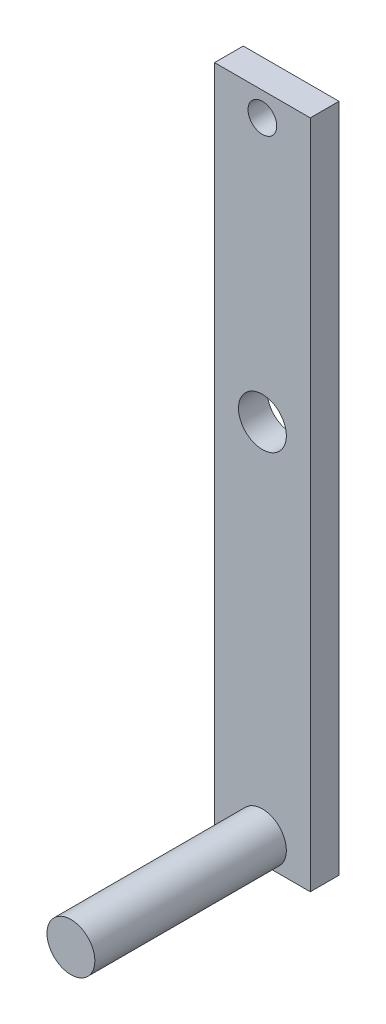
ISO-10303-21;
HEADER;
FILE_DESCRIPTION(('STEP AP214'),'2;1');
FILE_NAME('part.step','',(''),(''),'','','');
FILE_SCHEMA(('AUTOMOTIVE_DESIGN { 1 0 10303 214 1 1 1 1 }'));
ENDSEC;
DATA;
#1=APPLICATION_CONTEXT('core data for automotive mechanical design processes');
#2=APPLICATION_PROTOCOL_DEFINITION('international standard','automotive_design',2000,#1);
#3=PRODUCT_CONTEXT('',#1,'mechanical');
#4=PRODUCT('Part','Part','',(#3));
#5=PRODUCT_RELATED_PRODUCT_CATEGORY('part','',(#4));
#6=PRODUCT_DEFINITION_FORMATION('','',#4);
#7=PRODUCT_DEFINITION_CONTEXT('part definition',#1,'design');
#8=PRODUCT_DEFINITION('design','',#6,#7);
#9=PRODUCT_DEFINITION_SHAPE('','',#8);
#10=(LENGTH_UNIT() NAMED_UNIT(*) SI_UNIT(.MILLI.,.METRE.));
#11=(NAMED_UNIT(*) PLANE_ANGLE_UNIT() SI_UNIT($,.RADIAN.));
#12=(NAMED_UNIT(*) SI_UNIT($,.STERADIAN.) SOLID_ANGLE_UNIT());
#13=UNCERTAINTY_MEASURE_WITH_UNIT(LENGTH_MEASURE(1.E-05),#10,'distance_accuracy_value','');
#14=(GEOMETRIC_REPRESENTATION_CONTEXT(3) GLOBAL_UNCERTAINTY_ASSIGNED_CONTEXT((#13)) GLOBAL_UNIT_ASSIGNED_CONTEXT((#10,
#11,#12)) REPRESENTATION_CONTEXT('',''));
#15=CARTESIAN_POINT('',(0.,0.,0.));
#16=DIRECTION('',(0.,0.,1.));
#17=DIRECTION('',(1.,0.,0.));
#18=AXIS2_PLACEMENT_3D('',#15,#16,#17);
#19=CARTESIAN_POINT('',(0.,0.,3.));
#20=DIRECTION('',(1.,0.,0.));
#21=DIRECTION('',(0.,0.,-1.));
#22=AXIS2_PLACEMENT_3D('',#19,#20,#21);
#23=PLANE('',#22);
#24=DIRECTION('',(0.,-1.,0.));
#25=VECTOR('',#24,1.);
#26=CARTESIAN_POINT('',(0.,0.,0.));
#27=LINE('',#26,#25);
#28=CARTESIAN_POINT('',(0.,70.,0.));
#29=VERTEX_POINT('',#28);
#30=CARTESIAN_POINT('',(0.,0.,0.));
#31=VERTEX_POINT('',#30);
#32=EDGE_CURVE('E102',#29,#31,#27,.T.);
#33=ORIENTED_EDGE('',*,*,#32,.T.);
#34=DIRECTION('',(0.,0.,-1.));
#35=VECTOR('',#34,1.);
#36=CARTESIAN_POINT('',(0.,0.,3.));
#37=LINE('',#36,#35);
#38=CARTESIAN_POINT('',(0.,0.,3.));
#39=VERTEX_POINT('',#38);
#40=EDGE_CURVE('E11',#39,#31,#37,.T.);
#41=ORIENTED_EDGE('',*,*,#40,.F.);
#42=DIRECTION('',(0.,-1.,0.));
#43=VECTOR('',#42,1.);
#44=CARTESIAN_POINT('',(0.,0.,3.));
#45=LINE('',#44,#43);
#46=CARTESIAN_POINT('',(0.,70.,3.));
#47=VERTEX_POINT('',#46);
#48=EDGE_CURVE('E88',#47,#39,#45,.T.);
#49=ORIENTED_EDGE('',*,*,#48,.F.);
#50=DIRECTION('',(0.,0.,-1.));
#51=VECTOR('',#50,1.);
#52=CARTESIAN_POINT('',(0.,70.,3.));
#53=LINE('',#52,#51);
#54=EDGE_CURVE('E101',#47,#29,#53,.T.);
#55=ORIENTED_EDGE('',*,*,#54,.T.);
#56=EDGE_LOOP('',(#33,#41,#49,#55));
#57=FACE_BOUND('',#56,.T.);
#58=ADVANCED_FACE('F33',(#57),#23,.F.);
#59=CARTESIAN_POINT('',(0.,0.,3.));
#60=DIRECTION('',(0.,1.,0.));
#61=DIRECTION('',(0.,0.,1.));
#62=AXIS2_PLACEMENT_3D('',#59,#60,#61);
#63=PLANE('',#62);
#64=DIRECTION('',(1.,0.,0.));
#65=VECTOR('',#64,1.);
#66=CARTESIAN_POINT('',(0.,0.,0.));
#67=LINE('',#66,#65);
#68=CARTESIAN_POINT('',(10.,0.,0.));
#69=VERTEX_POINT('',#68);
#70=EDGE_CURVE('E105',#31,#69,#67,.T.);
#71=ORIENTED_EDGE('',*,*,#70,.T.);
#72=DIRECTION('',(0.,0.,-1.));
#73=VECTOR('',#72,1.);
#74=CARTESIAN_POINT('',(10.,0.,3.));
#75=LINE('',#74,#73);
#76=CARTESIAN_POINT('',(10.,0.,3.));
#77=VERTEX_POINT('',#76);
#78=EDGE_CURVE('E41',#77,#69,#75,.T.);
#79=ORIENTED_EDGE('',*,*,#78,.F.);
#80=DIRECTION('',(1.,0.,0.));
#81=VECTOR('',#80,1.);
#82=CARTESIAN_POINT('',(0.,0.,3.));
#83=LINE('',#82,#81);
#84=CARTESIAN_POINT('',(5.,0.,3.));
#85=VERTEX_POINT('',#84);
#86=EDGE_CURVE('E91',#85,#77,#83,.T.);
#87=ORIENTED_EDGE('',*,*,#86,.F.);
#88=EDGE_CURVE('E80',#39,#85,#83,.T.);
#89=ORIENTED_EDGE('',*,*,#88,.F.);
#90=ORIENTED_EDGE('',*,*,#40,.T.);
#91=EDGE_LOOP('',(#71,#79,#87,#89,#90));
#92=FACE_BOUND('',#91,.T.);
#93=ADVANCED_FACE('F94',(#92),#63,.F.);
#94=CARTESIAN_POINT('',(10.,0.,3.));
#95=DIRECTION('',(-1.,0.,0.));
#96=DIRECTION('',(0.,0.,1.));
#97=AXIS2_PLACEMENT_3D('',#94,#95,#96);
#98=PLANE('',#97);
#99=DIRECTION('',(0.,1.,0.));
#100=VECTOR('',#99,1.);
#101=CARTESIAN_POINT('',(10.,0.,0.));
#102=LINE('',#101,#100);
#103=CARTESIAN_POINT('',(10.,70.,0.));
#104=VERTEX_POINT('',#103);
#105=EDGE_CURVE('E67',#69,#104,#102,.T.);
#106=ORIENTED_EDGE('',*,*,#105,.T.);
#107=DIRECTION('',(0.,0.,-1.));
#108=VECTOR('',#107,1.);
#109=CARTESIAN_POINT('',(10.,70.,3.));
#110=LINE('',#109,#108);
#111=CARTESIAN_POINT('',(10.,70.,3.));
#112=VERTEX_POINT('',#111);
#113=EDGE_CURVE('E111',#112,#104,#110,.T.);
#114=ORIENTED_EDGE('',*,*,#113,.F.);
#115=DIRECTION('',(0.,1.,0.));
#116=VECTOR('',#115,1.);
#117=CARTESIAN_POINT('',(10.,0.,3.));
#118=LINE('',#117,#116);
#119=EDGE_CURVE('E90',#77,#112,#118,.T.);
#120=ORIENTED_EDGE('',*,*,#119,.F.);
#121=ORIENTED_EDGE('',*,*,#78,.T.);
#122=EDGE_LOOP('',(#106,#114,#120,#121));
#123=FACE_BOUND('',#122,.T.);
#124=ADVANCED_FACE('F112',(#123),#98,.F.);
#125=CARTESIAN_POINT('',(0.,70.,3.));
#126=DIRECTION('',(0.,-1.,0.));
#127=DIRECTION('',(0.,0.,-1.));
#128=AXIS2_PLACEMENT_3D('',#125,#126,#127);
#129=PLANE('',#128);
#130=DIRECTION('',(-1.,0.,0.));
#131=VECTOR('',#130,1.);
#132=CARTESIAN_POINT('',(0.,70.,0.));
#133=LINE('',#132,#131);
#134=EDGE_CURVE('E73',#104,#29,#133,.T.);
#135=ORIENTED_EDGE('',*,*,#134,.T.);
#136=ORIENTED_EDGE('',*,*,#54,.F.);
#137=DIRECTION('',(-1.,0.,0.));
#138=VECTOR('',#137,1.);
#139=CARTESIAN_POINT('',(0.,70.,3.));
#140=LINE('',#139,#138);
#141=EDGE_CURVE('E49',#112,#47,#140,.T.);
#142=ORIENTED_EDGE('',*,*,#141,.F.);
#143=ORIENTED_EDGE('',*,*,#113,.T.);
#144=EDGE_LOOP('',(#135,#136,#142,#143));
#145=FACE_BOUND('',#144,.T.);
#146=ADVANCED_FACE('F117',(#145),#129,.F.);
#147=CARTESIAN_POINT('',(0.,0.,3.));
#148=DIRECTION('',(0.,0.,-1.));
#149=DIRECTION('',(-1.,0.,0.));
#150=AXIS2_PLACEMENT_3D('',#147,#148,#149);
#151=PLANE('',#150);
#152=CARTESIAN_POINT('',(5.,40.,3.));
#153=DIRECTION('',(0.,0.,-1.));
#154=DIRECTION('',(-1.,0.,0.));
#155=AXIS2_PLACEMENT_3D('',#152,#153,#154);
#156=CIRCLE('',#155,2.5);
#157=CARTESIAN_POINT('',(2.5,40.,3.));
#158=VERTEX_POINT('',#157);
#159=EDGE_CURVE('E208',#158,#158,#156,.T.);
#160=ORIENTED_EDGE('',*,*,#159,.T.);
#161=EDGE_LOOP('',(#160));
#162=FACE_BOUND('',#161,.T.);
#163=CARTESIAN_POINT('',(5.,67.5,3.));
#164=DIRECTION('',(0.,0.,-1.));
#165=DIRECTION('',(-1.,0.,0.));
#166=AXIS2_PLACEMENT_3D('',#163,#164,#165);
#167=CIRCLE('',#166,1.5);
#168=CARTESIAN_POINT('',(3.5,67.5,3.));
#169=VERTEX_POINT('',#168);
#170=EDGE_CURVE('E212',#169,#169,#167,.T.);
#171=ORIENTED_EDGE('',*,*,#170,.T.);
#172=EDGE_LOOP('',(#171));
#173=FACE_BOUND('',#172,.T.);
#174=ORIENTED_EDGE('',*,*,#88,.T.);
#175=CARTESIAN_POINT('',(5.,2.5,3.));
#176=DIRECTION('',(0.,0.,1.));
#177=DIRECTION('',(1.,0.,0.));
#178=AXIS2_PLACEMENT_3D('',#175,#176,#177);
#179=CIRCLE('',#178,2.5);
#180=EDGE_CURVE('E86',#85,#85,#179,.T.);
#181=ORIENTED_EDGE('',*,*,#180,.F.);
#182=ORIENTED_EDGE('',*,*,#86,.T.);
#183=ORIENTED_EDGE('',*,*,#119,.T.);
#184=ORIENTED_EDGE('',*,*,#141,.T.);
#185=ORIENTED_EDGE('',*,*,#48,.T.);
#186=EDGE_LOOP('',(#174,#181,#182,#183,#184,#185));
#187=FACE_BOUND('',#186,.T.);
#188=ADVANCED_FACE('F84',(#162,#173,#187),#151,.F.);
#189=CARTESIAN_POINT('',(0.,0.,0.));
#190=DIRECTION('',(0.,0.,-1.));
#191=DIRECTION('',(-1.,0.,0.));
#192=AXIS2_PLACEMENT_3D('',#189,#190,#191);
#193=PLANE('',#192);
#194=CARTESIAN_POINT('',(5.,40.,0.));
#195=DIRECTION('',(0.,0.,-1.));
#196=DIRECTION('',(-1.,0.,0.));
#197=AXIS2_PLACEMENT_3D('',#194,#195,#196);
#198=CIRCLE('',#197,2.5);
#199=CARTESIAN_POINT('',(2.5,40.,0.));
#200=VERTEX_POINT('',#199);
#201=EDGE_CURVE('E205',#200,#200,#198,.T.);
#202=ORIENTED_EDGE('',*,*,#201,.F.);
#203=EDGE_LOOP('',(#202));
#204=FACE_BOUND('',#203,.T.);
#205=CARTESIAN_POINT('',(5.,67.5,0.));
#206=DIRECTION('',(0.,0.,-1.));
#207=DIRECTION('',(-1.,0.,0.));
#208=AXIS2_PLACEMENT_3D('',#205,#206,#207);
#209=CIRCLE('',#208,1.5);
#210=CARTESIAN_POINT('',(3.5,67.5,0.));
#211=VERTEX_POINT('',#210);
#212=EDGE_CURVE('E209',#211,#211,#209,.T.);
#213=ORIENTED_EDGE('',*,*,#212,.F.);
#214=EDGE_LOOP('',(#213));
#215=FACE_BOUND('',#214,.T.);
#216=ORIENTED_EDGE('',*,*,#32,.F.);
#217=ORIENTED_EDGE('',*,*,#134,.F.);
#218=ORIENTED_EDGE('',*,*,#105,.F.);
#219=ORIENTED_EDGE('',*,*,#70,.F.);
#220=EDGE_LOOP('',(#216,#217,#218,#219));
#221=FACE_BOUND('',#220,.T.);
#222=ADVANCED_FACE('F115',(#204,#215,#221),#193,.T.);
#223=CARTESIAN_POINT('',(5.,2.5,23.));
#224=DIRECTION('',(0.,0.,-1.));
#225=DIRECTION('',(-1.,0.,0.));
#226=AXIS2_PLACEMENT_3D('',#223,#224,#225);
#227=CYLINDRICAL_SURFACE('',#226,2.5);
#228=CARTESIAN_POINT('',(5.,2.5,23.));
#229=DIRECTION('',(0.,0.,1.));
#230=DIRECTION('',(1.,0.,0.));
#231=AXIS2_PLACEMENT_3D('',#228,#229,#230);
#232=CIRCLE('',#231,2.5);
#233=CARTESIAN_POINT('',(7.5,2.5,23.));
#234=VERTEX_POINT('',#233);
#235=EDGE_CURVE('E106',#234,#234,#232,.T.);
#236=ORIENTED_EDGE('',*,*,#235,.F.);
#237=EDGE_LOOP('',(#236));
#238=FACE_BOUND('',#237,.T.);
#239=ORIENTED_EDGE('',*,*,#180,.T.);
#240=EDGE_LOOP('',(#239));
#241=FACE_BOUND('',#240,.T.);
#242=ADVANCED_FACE('F161',(#238,#241),#227,.T.);
#243=CARTESIAN_POINT('',(5.,2.5,23.));
#244=DIRECTION('',(0.,0.,1.));
#245=DIRECTION('',(1.,0.,0.));
#246=AXIS2_PLACEMENT_3D('',#243,#244,#245);
#247=PLANE('',#246);
#248=ORIENTED_EDGE('',*,*,#235,.T.);
#249=EDGE_LOOP('',(#248));
#250=FACE_BOUND('',#249,.T.);
#251=ADVANCED_FACE('F169',(#250),#247,.T.);
#252=CARTESIAN_POINT('',(5.,67.5,20.));
#253=DIRECTION('',(0.,0.,-1.));
#254=DIRECTION('',(-1.,0.,0.));
#255=AXIS2_PLACEMENT_3D('',#252,#253,#254);
#256=CYLINDRICAL_SURFACE('',#255,1.5);
#257=ORIENTED_EDGE('',*,*,#212,.T.);
#258=EDGE_LOOP('',(#257));
#259=FACE_BOUND('',#258,.T.);
#260=ORIENTED_EDGE('',*,*,#170,.F.);
#261=EDGE_LOOP('',(#260));
#262=FACE_BOUND('',#261,.T.);
#263=ADVANCED_FACE('F178',(#259,#262),#256,.F.);
#264=CARTESIAN_POINT('',(5.,40.,20.));
#265=DIRECTION('',(0.,0.,-1.));
#266=DIRECTION('',(-1.,0.,0.));
#267=AXIS2_PLACEMENT_3D('',#264,#265,#266);
#268=CYLINDRICAL_SURFACE('',#267,2.5);
#269=ORIENTED_EDGE('',*,*,#201,.T.);
#270=EDGE_LOOP('',(#269));
#271=FACE_BOUND('',#270,.T.);
#272=ORIENTED_EDGE('',*,*,#159,.F.);
#273=EDGE_LOOP('',(#272));
#274=FACE_BOUND('',#273,.T.);
#275=ADVANCED_FACE('F186',(#271,#274),#268,.F.);
#276=CLOSED_SHELL('',(#58,#93,#124,#146,#188,#222,#242,#251,#263,#275));
#277=MANIFOLD_SOLID_BREP('B2',#276);
#278=ADVANCED_BREP_SHAPE_REPRESENTATION('',(#18,#277),#14);
#279=SHAPE_DEFINITION_REPRESENTATION(#9,#278);
ENDSEC;
END-ISO-10303-21;
